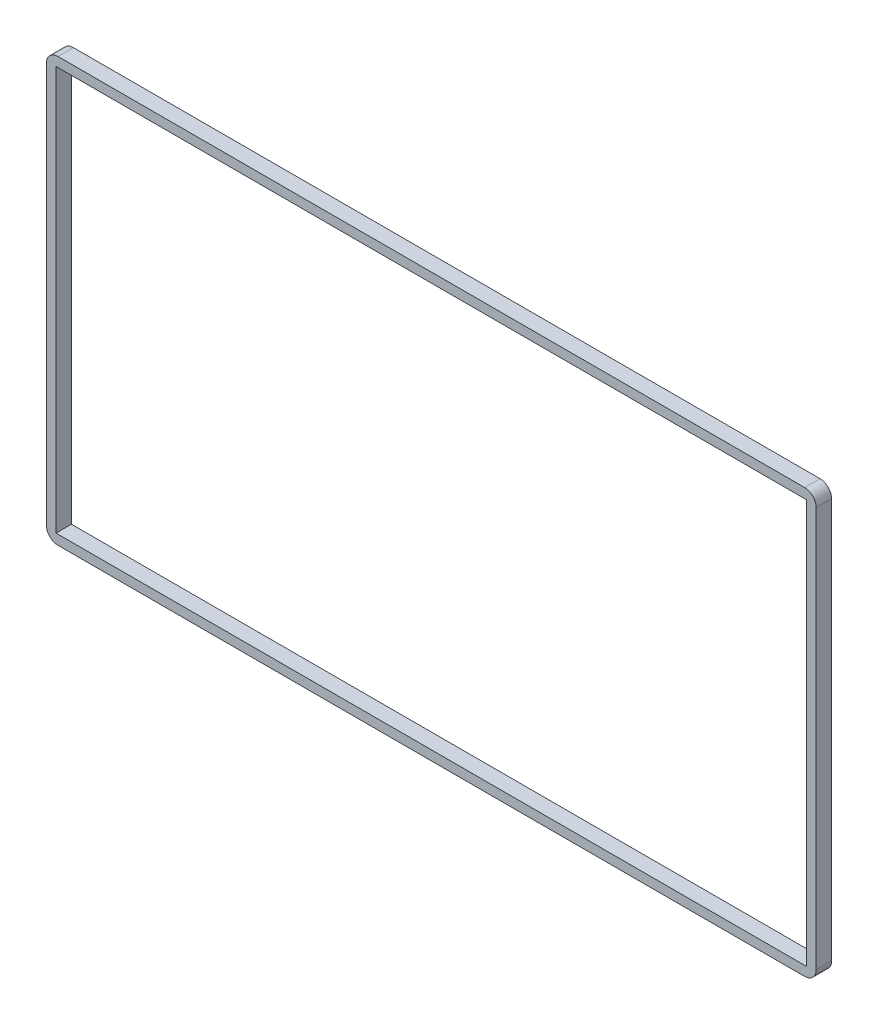
ISO-10303-21;
HEADER;
FILE_DESCRIPTION(('STEP AP214'),'2;1');
FILE_NAME('part.step','',(''),(''),'','','');
FILE_SCHEMA(('AUTOMOTIVE_DESIGN { 1 0 10303 214 1 1 1 1 }'));
ENDSEC;
DATA;
#1=APPLICATION_CONTEXT('core data for automotive mechanical design processes');
#2=APPLICATION_PROTOCOL_DEFINITION('international standard','automotive_design',2000,#1);
#3=PRODUCT_CONTEXT('',#1,'mechanical');
#4=PRODUCT('Part','Part','',(#3));
#5=PRODUCT_RELATED_PRODUCT_CATEGORY('part','',(#4));
#6=PRODUCT_DEFINITION_FORMATION('','',#4);
#7=PRODUCT_DEFINITION_CONTEXT('part definition',#1,'design');
#8=PRODUCT_DEFINITION('design','',#6,#7);
#9=PRODUCT_DEFINITION_SHAPE('','',#8);
#10=(LENGTH_UNIT() NAMED_UNIT(*) SI_UNIT(.MILLI.,.METRE.));
#11=(NAMED_UNIT(*) PLANE_ANGLE_UNIT() SI_UNIT($,.RADIAN.));
#12=(NAMED_UNIT(*) SI_UNIT($,.STERADIAN.) SOLID_ANGLE_UNIT());
#13=UNCERTAINTY_MEASURE_WITH_UNIT(LENGTH_MEASURE(1.E-05),#10,'distance_accuracy_value','');
#14=(GEOMETRIC_REPRESENTATION_CONTEXT(3) GLOBAL_UNCERTAINTY_ASSIGNED_CONTEXT((#13)) GLOBAL_UNIT_ASSIGNED_CONTEXT((#10,
#11,#12)) REPRESENTATION_CONTEXT('',''));
#15=CARTESIAN_POINT('',(0.,0.,0.));
#16=DIRECTION('',(0.,0.,1.));
#17=DIRECTION('',(1.,0.,0.));
#18=AXIS2_PLACEMENT_3D('',#15,#16,#17);
#19=CARTESIAN_POINT('',(0.,0.,2.));
#20=DIRECTION('',(0.,0.,-1.));
#21=DIRECTION('',(-1.,0.,0.));
#22=AXIS2_PLACEMENT_3D('',#19,#20,#21);
#23=PLANE('',#22);
#24=DIRECTION('',(0.,-1.,0.));
#25=VECTOR('',#24,1.);
#26=CARTESIAN_POINT('',(-37.8969711699355,-16.3484963131282,2.));
#27=LINE('',#26,#25);
#28=CARTESIAN_POINT('',(-37.8969711699355,37.1515036868718,2.));
#29=VERTEX_POINT('',#28);
#30=CARTESIAN_POINT('',(-37.8969711699355,-14.8484963131282,2.));
#31=VERTEX_POINT('',#30);
#32=EDGE_CURVE('E168',#29,#31,#27,.T.);
#33=ORIENTED_EDGE('',*,*,#32,.T.);
#34=CARTESIAN_POINT('',(-36.3969711699355,-14.8484963131282,2.));
#35=DIRECTION('',(0.,0.,-1.));
#36=DIRECTION('',(-1.,0.,0.));
#37=AXIS2_PLACEMENT_3D('',#34,#35,#36);
#38=CIRCLE('',#37,1.5);
#39=CARTESIAN_POINT('',(-36.3969711699355,-16.3484963131282,2.));
#40=VERTEX_POINT('',#39);
#41=EDGE_CURVE('E211',#31,#40,#38,.F.);
#42=ORIENTED_EDGE('',*,*,#41,.T.);
#43=DIRECTION('',(1.,0.,0.));
#44=VECTOR('',#43,1.);
#45=CARTESIAN_POINT('',(-37.8969711699355,-16.3484963131282,2.));
#46=LINE('',#45,#44);
#47=CARTESIAN_POINT('',(60.6030288300645,-16.3484963131282,2.));
#48=VERTEX_POINT('',#47);
#49=EDGE_CURVE('E171',#40,#48,#46,.T.);
#50=ORIENTED_EDGE('',*,*,#49,.T.);
#51=CARTESIAN_POINT('',(60.6030288300645,-14.8484963131282,2.));
#52=DIRECTION('',(0.,0.,-1.));
#53=DIRECTION('',(-1.,0.,0.));
#54=AXIS2_PLACEMENT_3D('',#51,#52,#53);
#55=CIRCLE('',#54,1.5);
#56=CARTESIAN_POINT('',(62.1030288300645,-14.8484963131282,2.));
#57=VERTEX_POINT('',#56);
#58=EDGE_CURVE('E209',#48,#57,#55,.F.);
#59=ORIENTED_EDGE('',*,*,#58,.T.);
#60=DIRECTION('',(0.,1.,0.));
#61=VECTOR('',#60,1.);
#62=CARTESIAN_POINT('',(62.1030288300645,-16.3484963131282,2.));
#63=LINE('',#62,#61);
#64=CARTESIAN_POINT('',(62.1030288300645,37.1515036868718,2.));
#65=VERTEX_POINT('',#64);
#66=EDGE_CURVE('E175',#57,#65,#63,.T.);
#67=ORIENTED_EDGE('',*,*,#66,.T.);
#68=CARTESIAN_POINT('',(60.6030288300645,37.1515036868718,2.));
#69=DIRECTION('',(0.,0.,-1.));
#70=DIRECTION('',(-1.,0.,0.));
#71=AXIS2_PLACEMENT_3D('',#68,#69,#70);
#72=CIRCLE('',#71,1.5);
#73=CARTESIAN_POINT('',(60.6030288300645,38.6515036868718,2.));
#74=VERTEX_POINT('',#73);
#75=EDGE_CURVE('E57',#65,#74,#72,.F.);
#76=ORIENTED_EDGE('',*,*,#75,.T.);
#77=DIRECTION('',(-1.,0.,0.));
#78=VECTOR('',#77,1.);
#79=CARTESIAN_POINT('',(-37.8969711699355,38.6515036868718,2.));
#80=LINE('',#79,#78);
#81=CARTESIAN_POINT('',(-36.3969711699355,38.6515036868718,2.));
#82=VERTEX_POINT('',#81);
#83=EDGE_CURVE('E177',#74,#82,#80,.T.);
#84=ORIENTED_EDGE('',*,*,#83,.T.);
#85=CARTESIAN_POINT('',(-36.3969711699355,37.1515036868718,2.));
#86=DIRECTION('',(0.,0.,-1.));
#87=DIRECTION('',(-1.,0.,0.));
#88=AXIS2_PLACEMENT_3D('',#85,#86,#87);
#89=CIRCLE('',#88,1.5);
#90=EDGE_CURVE('E206',#82,#29,#89,.F.);
#91=ORIENTED_EDGE('',*,*,#90,.T.);
#92=EDGE_LOOP('',(#33,#42,#50,#59,#67,#76,#84,#91));
#93=FACE_BOUND('',#92,.T.);
#94=DIRECTION('',(0.,-1.,0.));
#95=VECTOR('',#94,1.);
#96=CARTESIAN_POINT('',(-36.6469711699355,37.4015036868718,2.));
#97=LINE('',#96,#95);
#98=CARTESIAN_POINT('',(-36.6469711699355,37.4015036868718,2.));
#99=VERTEX_POINT('',#98);
#100=CARTESIAN_POINT('',(-36.6469711699355,-15.0984963131282,2.));
#101=VERTEX_POINT('',#100);
#102=EDGE_CURVE('E127',#99,#101,#97,.T.);
#103=ORIENTED_EDGE('',*,*,#102,.F.);
#104=DIRECTION('',(-1.,0.,0.));
#105=VECTOR('',#104,1.);
#106=CARTESIAN_POINT('',(-36.6469711699355,37.4015036868718,2.));
#107=LINE('',#106,#105);
#108=CARTESIAN_POINT('',(60.8530288300645,37.4015036868718,2.));
#109=VERTEX_POINT('',#108);
#110=EDGE_CURVE('E152',#109,#99,#107,.T.);
#111=ORIENTED_EDGE('',*,*,#110,.F.);
#112=DIRECTION('',(0.,1.,0.));
#113=VECTOR('',#112,1.);
#114=CARTESIAN_POINT('',(60.8530288300645,37.4015036868718,2.));
#115=LINE('',#114,#113);
#116=CARTESIAN_POINT('',(60.8530288300645,-15.0984963131282,2.));
#117=VERTEX_POINT('',#116);
#118=EDGE_CURVE('E150',#117,#109,#115,.T.);
#119=ORIENTED_EDGE('',*,*,#118,.F.);
#120=DIRECTION('',(1.,0.,0.));
#121=VECTOR('',#120,1.);
#122=CARTESIAN_POINT('',(-36.6469711699355,-15.0984963131282,2.));
#123=LINE('',#122,#121);
#124=EDGE_CURVE('E137',#101,#117,#123,.T.);
#125=ORIENTED_EDGE('',*,*,#124,.F.);
#126=EDGE_LOOP('',(#103,#111,#119,#125));
#127=FACE_BOUND('',#126,.T.);
#128=ADVANCED_FACE('F36',(#93,#127),#23,.F.);
#129=CARTESIAN_POINT('',(0.,0.,0.));
#130=DIRECTION('',(0.,0.,-1.));
#131=DIRECTION('',(-1.,0.,0.));
#132=AXIS2_PLACEMENT_3D('',#129,#130,#131);
#133=PLANE('',#132);
#134=DIRECTION('',(1.,0.,0.));
#135=VECTOR('',#134,1.);
#136=CARTESIAN_POINT('',(-37.8969711699355,-16.3484963131282,0.));
#137=LINE('',#136,#135);
#138=CARTESIAN_POINT('',(-36.3969711699355,-16.3484963131282,0.));
#139=VERTEX_POINT('',#138);
#140=CARTESIAN_POINT('',(60.6030288300645,-16.3484963131282,0.));
#141=VERTEX_POINT('',#140);
#142=EDGE_CURVE('E182',#139,#141,#137,.T.);
#143=ORIENTED_EDGE('',*,*,#142,.F.);
#144=CARTESIAN_POINT('',(-36.3969711699355,-14.8484963131282,0.));
#145=DIRECTION('',(0.,0.,-1.));
#146=DIRECTION('',(-1.,0.,0.));
#147=AXIS2_PLACEMENT_3D('',#144,#145,#146);
#148=CIRCLE('',#147,1.5);
#149=CARTESIAN_POINT('',(-37.8969711699355,-14.8484963131282,0.));
#150=VERTEX_POINT('',#149);
#151=EDGE_CURVE('E199',#139,#150,#148,.T.);
#152=ORIENTED_EDGE('',*,*,#151,.T.);
#153=DIRECTION('',(0.,-1.,0.));
#154=VECTOR('',#153,1.);
#155=CARTESIAN_POINT('',(-37.8969711699355,-16.3484963131282,0.));
#156=LINE('',#155,#154);
#157=CARTESIAN_POINT('',(-37.8969711699355,37.1515036868718,0.));
#158=VERTEX_POINT('',#157);
#159=EDGE_CURVE('E145',#158,#150,#156,.T.);
#160=ORIENTED_EDGE('',*,*,#159,.F.);
#161=CARTESIAN_POINT('',(-36.3969711699355,37.1515036868718,0.));
#162=DIRECTION('',(0.,0.,-1.));
#163=DIRECTION('',(-1.,0.,0.));
#164=AXIS2_PLACEMENT_3D('',#161,#162,#163);
#165=CIRCLE('',#164,1.5);
#166=CARTESIAN_POINT('',(-36.3969711699355,38.6515036868718,0.));
#167=VERTEX_POINT('',#166);
#168=EDGE_CURVE('E193',#158,#167,#165,.T.);
#169=ORIENTED_EDGE('',*,*,#168,.T.);
#170=DIRECTION('',(-1.,0.,0.));
#171=VECTOR('',#170,1.);
#172=CARTESIAN_POINT('',(-37.8969711699355,38.6515036868718,0.));
#173=LINE('',#172,#171);
#174=CARTESIAN_POINT('',(60.6030288300645,38.6515036868718,0.));
#175=VERTEX_POINT('',#174);
#176=EDGE_CURVE('E172',#175,#167,#173,.T.);
#177=ORIENTED_EDGE('',*,*,#176,.F.);
#178=CARTESIAN_POINT('',(60.6030288300645,37.1515036868718,0.));
#179=DIRECTION('',(0.,0.,-1.));
#180=DIRECTION('',(-1.,0.,0.));
#181=AXIS2_PLACEMENT_3D('',#178,#179,#180);
#182=CIRCLE('',#181,1.5);
#183=CARTESIAN_POINT('',(62.1030288300645,37.1515036868718,0.));
#184=VERTEX_POINT('',#183);
#185=EDGE_CURVE('E195',#175,#184,#182,.T.);
#186=ORIENTED_EDGE('',*,*,#185,.T.);
#187=DIRECTION('',(0.,1.,0.));
#188=VECTOR('',#187,1.);
#189=CARTESIAN_POINT('',(62.1030288300645,-16.3484963131282,0.));
#190=LINE('',#189,#188);
#191=CARTESIAN_POINT('',(62.1030288300645,-14.8484963131282,0.));
#192=VERTEX_POINT('',#191);
#193=EDGE_CURVE('E185',#192,#184,#190,.T.);
#194=ORIENTED_EDGE('',*,*,#193,.F.);
#195=CARTESIAN_POINT('',(60.6030288300645,-14.8484963131282,0.));
#196=DIRECTION('',(0.,0.,-1.));
#197=DIRECTION('',(-1.,0.,0.));
#198=AXIS2_PLACEMENT_3D('',#195,#196,#197);
#199=CIRCLE('',#198,1.5);
#200=EDGE_CURVE('E197',#192,#141,#199,.T.);
#201=ORIENTED_EDGE('',*,*,#200,.T.);
#202=EDGE_LOOP('',(#143,#152,#160,#169,#177,#186,#194,#201));
#203=FACE_BOUND('',#202,.T.);
#204=DIRECTION('',(-1.,0.,0.));
#205=VECTOR('',#204,1.);
#206=CARTESIAN_POINT('',(-36.6469711699355,37.4015036868718,0.));
#207=LINE('',#206,#205);
#208=CARTESIAN_POINT('',(60.8530288300645,37.4015036868718,0.));
#209=VERTEX_POINT('',#208);
#210=CARTESIAN_POINT('',(-36.6469711699355,37.4015036868718,0.));
#211=VERTEX_POINT('',#210);
#212=EDGE_CURVE('E138',#209,#211,#207,.T.);
#213=ORIENTED_EDGE('',*,*,#212,.T.);
#214=DIRECTION('',(0.,-1.,0.));
#215=VECTOR('',#214,1.);
#216=CARTESIAN_POINT('',(-36.6469711699355,37.4015036868718,0.));
#217=LINE('',#216,#215);
#218=CARTESIAN_POINT('',(-36.6469711699355,-15.0984963131282,0.));
#219=VERTEX_POINT('',#218);
#220=EDGE_CURVE('E156',#211,#219,#217,.T.);
#221=ORIENTED_EDGE('',*,*,#220,.T.);
#222=DIRECTION('',(1.,0.,0.));
#223=VECTOR('',#222,1.);
#224=CARTESIAN_POINT('',(-36.6469711699355,-15.0984963131282,0.));
#225=LINE('',#224,#223);
#226=CARTESIAN_POINT('',(60.8530288300645,-15.0984963131282,0.));
#227=VERTEX_POINT('',#226);
#228=EDGE_CURVE('E144',#219,#227,#225,.T.);
#229=ORIENTED_EDGE('',*,*,#228,.T.);
#230=DIRECTION('',(0.,1.,0.));
#231=VECTOR('',#230,1.);
#232=CARTESIAN_POINT('',(60.8530288300645,37.4015036868718,0.));
#233=LINE('',#232,#231);
#234=EDGE_CURVE('E159',#227,#209,#233,.T.);
#235=ORIENTED_EDGE('',*,*,#234,.T.);
#236=EDGE_LOOP('',(#213,#221,#229,#235));
#237=FACE_BOUND('',#236,.T.);
#238=ADVANCED_FACE('F227',(#203,#237),#133,.T.);
#239=CARTESIAN_POINT('',(-37.8969711699355,-16.3484963131282,2.));
#240=DIRECTION('',(1.,0.,0.));
#241=DIRECTION('',(0.,0.,-1.));
#242=AXIS2_PLACEMENT_3D('',#239,#240,#241);
#243=PLANE('',#242);
#244=ORIENTED_EDGE('',*,*,#159,.T.);
#245=DIRECTION('',(0.,0.,-1.));
#246=VECTOR('',#245,1.);
#247=CARTESIAN_POINT('',(-37.8969711699355,-14.8484963131282,2.));
#248=LINE('',#247,#246);
#249=EDGE_CURVE('E204',#150,#31,#248,.F.);
#250=ORIENTED_EDGE('',*,*,#249,.T.);
#251=ORIENTED_EDGE('',*,*,#32,.F.);
#252=DIRECTION('',(0.,0.,-1.));
#253=VECTOR('',#252,1.);
#254=CARTESIAN_POINT('',(-37.8969711699355,37.1515036868718,2.));
#255=LINE('',#254,#253);
#256=EDGE_CURVE('E201',#29,#158,#255,.T.);
#257=ORIENTED_EDGE('',*,*,#256,.T.);
#258=EDGE_LOOP('',(#244,#250,#251,#257));
#259=FACE_BOUND('',#258,.T.);
#260=ADVANCED_FACE('F240',(#259),#243,.F.);
#261=CARTESIAN_POINT('',(-37.8969711699355,-16.3484963131282,2.));
#262=DIRECTION('',(0.,1.,0.));
#263=DIRECTION('',(0.,0.,1.));
#264=AXIS2_PLACEMENT_3D('',#261,#262,#263);
#265=PLANE('',#264);
#266=ORIENTED_EDGE('',*,*,#49,.F.);
#267=DIRECTION('',(0.,0.,-1.));
#268=VECTOR('',#267,1.);
#269=CARTESIAN_POINT('',(-36.3969711699355,-16.3484963131282,2.));
#270=LINE('',#269,#268);
#271=EDGE_CURVE('E190',#40,#139,#270,.T.);
#272=ORIENTED_EDGE('',*,*,#271,.T.);
#273=ORIENTED_EDGE('',*,*,#142,.T.);
#274=DIRECTION('',(0.,0.,-1.));
#275=VECTOR('',#274,1.);
#276=CARTESIAN_POINT('',(60.6030288300645,-16.3484963131282,2.));
#277=LINE('',#276,#275);
#278=EDGE_CURVE('E179',#141,#48,#277,.F.);
#279=ORIENTED_EDGE('',*,*,#278,.T.);
#280=EDGE_LOOP('',(#266,#272,#273,#279));
#281=FACE_BOUND('',#280,.T.);
#282=ADVANCED_FACE('F248',(#281),#265,.F.);
#283=CARTESIAN_POINT('',(62.1030288300645,-16.3484963131282,2.));
#284=DIRECTION('',(-1.,0.,0.));
#285=DIRECTION('',(0.,0.,1.));
#286=AXIS2_PLACEMENT_3D('',#283,#284,#285);
#287=PLANE('',#286);
#288=ORIENTED_EDGE('',*,*,#66,.F.);
#289=DIRECTION('',(0.,0.,-1.));
#290=VECTOR('',#289,1.);
#291=CARTESIAN_POINT('',(62.1030288300645,-14.8484963131282,2.));
#292=LINE('',#291,#290);
#293=EDGE_CURVE('E215',#57,#192,#292,.T.);
#294=ORIENTED_EDGE('',*,*,#293,.T.);
#295=ORIENTED_EDGE('',*,*,#193,.T.);
#296=DIRECTION('',(0.,0.,-1.));
#297=VECTOR('',#296,1.);
#298=CARTESIAN_POINT('',(62.1030288300645,37.1515036868718,2.));
#299=LINE('',#298,#297);
#300=EDGE_CURVE('E213',#184,#65,#299,.F.);
#301=ORIENTED_EDGE('',*,*,#300,.T.);
#302=EDGE_LOOP('',(#288,#294,#295,#301));
#303=FACE_BOUND('',#302,.T.);
#304=ADVANCED_FACE('F221',(#303),#287,.F.);
#305=CARTESIAN_POINT('',(-37.8969711699355,38.6515036868718,2.));
#306=DIRECTION('',(0.,-1.,0.));
#307=DIRECTION('',(0.,0.,-1.));
#308=AXIS2_PLACEMENT_3D('',#305,#306,#307);
#309=PLANE('',#308);
#310=ORIENTED_EDGE('',*,*,#83,.F.);
#311=DIRECTION('',(0.,0.,-1.));
#312=VECTOR('',#311,1.);
#313=CARTESIAN_POINT('',(60.6030288300645,38.6515036868718,2.));
#314=LINE('',#313,#312);
#315=EDGE_CURVE('E12',#74,#175,#314,.T.);
#316=ORIENTED_EDGE('',*,*,#315,.T.);
#317=ORIENTED_EDGE('',*,*,#176,.T.);
#318=DIRECTION('',(0.,0.,-1.));
#319=VECTOR('',#318,1.);
#320=CARTESIAN_POINT('',(-36.3969711699355,38.6515036868718,2.));
#321=LINE('',#320,#319);
#322=EDGE_CURVE('E44',#167,#82,#321,.F.);
#323=ORIENTED_EDGE('',*,*,#322,.T.);
#324=EDGE_LOOP('',(#310,#316,#317,#323));
#325=FACE_BOUND('',#324,.T.);
#326=ADVANCED_FACE('F233',(#325),#309,.F.);
#327=CARTESIAN_POINT('',(-36.6469711699355,37.4015036868718,2.));
#328=DIRECTION('',(1.,0.,0.));
#329=DIRECTION('',(0.,1.,0.));
#330=AXIS2_PLACEMENT_3D('',#327,#328,#329);
#331=PLANE('',#330);
#332=ORIENTED_EDGE('',*,*,#220,.F.);
#333=DIRECTION('',(0.,0.,-1.));
#334=VECTOR('',#333,1.);
#335=CARTESIAN_POINT('',(-36.6469711699355,37.4015036868718,2.));
#336=LINE('',#335,#334);
#337=EDGE_CURVE('E133',#99,#211,#336,.T.);
#338=ORIENTED_EDGE('',*,*,#337,.F.);
#339=ORIENTED_EDGE('',*,*,#102,.T.);
#340=DIRECTION('',(0.,0.,-1.));
#341=VECTOR('',#340,1.);
#342=CARTESIAN_POINT('',(-36.6469711699355,-15.0984963131282,2.));
#343=LINE('',#342,#341);
#344=EDGE_CURVE('E130',#101,#219,#343,.T.);
#345=ORIENTED_EDGE('',*,*,#344,.T.);
#346=EDGE_LOOP('',(#332,#338,#339,#345));
#347=FACE_BOUND('',#346,.T.);
#348=ADVANCED_FACE('F129',(#347),#331,.T.);
#349=CARTESIAN_POINT('',(-36.6469711699355,-15.0984963131282,2.));
#350=DIRECTION('',(0.,1.,0.));
#351=DIRECTION('',(-1.,0.,0.));
#352=AXIS2_PLACEMENT_3D('',#349,#350,#351);
#353=PLANE('',#352);
#354=ORIENTED_EDGE('',*,*,#228,.F.);
#355=ORIENTED_EDGE('',*,*,#344,.F.);
#356=ORIENTED_EDGE('',*,*,#124,.T.);
#357=DIRECTION('',(0.,0.,-1.));
#358=VECTOR('',#357,1.);
#359=CARTESIAN_POINT('',(60.8530288300645,-15.0984963131282,2.));
#360=LINE('',#359,#358);
#361=EDGE_CURVE('E146',#117,#227,#360,.T.);
#362=ORIENTED_EDGE('',*,*,#361,.T.);
#363=EDGE_LOOP('',(#354,#355,#356,#362));
#364=FACE_BOUND('',#363,.T.);
#365=ADVANCED_FACE('F141',(#364),#353,.T.);
#366=CARTESIAN_POINT('',(60.8530288300645,37.4015036868718,2.));
#367=DIRECTION('',(-1.,0.,0.));
#368=DIRECTION('',(0.,-1.,0.));
#369=AXIS2_PLACEMENT_3D('',#366,#367,#368);
#370=PLANE('',#369);
#371=ORIENTED_EDGE('',*,*,#234,.F.);
#372=ORIENTED_EDGE('',*,*,#361,.F.);
#373=ORIENTED_EDGE('',*,*,#118,.T.);
#374=DIRECTION('',(0.,0.,-1.));
#375=VECTOR('',#374,1.);
#376=CARTESIAN_POINT('',(60.8530288300645,37.4015036868718,2.));
#377=LINE('',#376,#375);
#378=EDGE_CURVE('E165',#109,#209,#377,.T.);
#379=ORIENTED_EDGE('',*,*,#378,.T.);
#380=EDGE_LOOP('',(#371,#372,#373,#379));
#381=FACE_BOUND('',#380,.T.);
#382=ADVANCED_FACE('F303',(#381),#370,.T.);
#383=CARTESIAN_POINT('',(-36.6469711699355,37.4015036868718,2.));
#384=DIRECTION('',(0.,-1.,0.));
#385=DIRECTION('',(0.,0.,-1.));
#386=AXIS2_PLACEMENT_3D('',#383,#384,#385);
#387=PLANE('',#386);
#388=ORIENTED_EDGE('',*,*,#212,.F.);
#389=ORIENTED_EDGE('',*,*,#378,.F.);
#390=ORIENTED_EDGE('',*,*,#110,.T.);
#391=ORIENTED_EDGE('',*,*,#337,.T.);
#392=EDGE_LOOP('',(#388,#389,#390,#391));
#393=FACE_BOUND('',#392,.T.);
#394=ADVANCED_FACE('F257',(#393),#387,.T.);
#395=CARTESIAN_POINT('',(-36.3969711699355,-14.8484963131282,2.));
#396=DIRECTION('',(0.,0.,-1.));
#397=DIRECTION('',(-1.,0.,0.));
#398=AXIS2_PLACEMENT_3D('',#395,#396,#397);
#399=CYLINDRICAL_SURFACE('',#398,1.5);
#400=ORIENTED_EDGE('',*,*,#41,.F.);
#401=ORIENTED_EDGE('',*,*,#249,.F.);
#402=ORIENTED_EDGE('',*,*,#151,.F.);
#403=ORIENTED_EDGE('',*,*,#271,.F.);
#404=EDGE_LOOP('',(#400,#401,#402,#403));
#405=FACE_BOUND('',#404,.T.);
#406=ADVANCED_FACE('F245',(#405),#399,.T.);
#407=CARTESIAN_POINT('',(60.6030288300645,-14.8484963131282,2.));
#408=DIRECTION('',(0.,0.,-1.));
#409=DIRECTION('',(-1.,0.,0.));
#410=AXIS2_PLACEMENT_3D('',#407,#408,#409);
#411=CYLINDRICAL_SURFACE('',#410,1.5);
#412=ORIENTED_EDGE('',*,*,#58,.F.);
#413=ORIENTED_EDGE('',*,*,#278,.F.);
#414=ORIENTED_EDGE('',*,*,#200,.F.);
#415=ORIENTED_EDGE('',*,*,#293,.F.);
#416=EDGE_LOOP('',(#412,#413,#414,#415));
#417=FACE_BOUND('',#416,.T.);
#418=ADVANCED_FACE('F250',(#417),#411,.T.);
#419=CARTESIAN_POINT('',(60.6030288300645,37.1515036868718,2.));
#420=DIRECTION('',(0.,0.,-1.));
#421=DIRECTION('',(-1.,0.,0.));
#422=AXIS2_PLACEMENT_3D('',#419,#420,#421);
#423=CYLINDRICAL_SURFACE('',#422,1.5);
#424=ORIENTED_EDGE('',*,*,#75,.F.);
#425=ORIENTED_EDGE('',*,*,#300,.F.);
#426=ORIENTED_EDGE('',*,*,#185,.F.);
#427=ORIENTED_EDGE('',*,*,#315,.F.);
#428=EDGE_LOOP('',(#424,#425,#426,#427));
#429=FACE_BOUND('',#428,.T.);
#430=ADVANCED_FACE('F232',(#429),#423,.T.);
#431=CARTESIAN_POINT('',(-36.3969711699355,37.1515036868718,2.));
#432=DIRECTION('',(0.,0.,-1.));
#433=DIRECTION('',(-1.,0.,0.));
#434=AXIS2_PLACEMENT_3D('',#431,#432,#433);
#435=CYLINDRICAL_SURFACE('',#434,1.5);
#436=ORIENTED_EDGE('',*,*,#90,.F.);
#437=ORIENTED_EDGE('',*,*,#322,.F.);
#438=ORIENTED_EDGE('',*,*,#168,.F.);
#439=ORIENTED_EDGE('',*,*,#256,.F.);
#440=EDGE_LOOP('',(#436,#437,#438,#439));
#441=FACE_BOUND('',#440,.T.);
#442=ADVANCED_FACE('F38',(#441),#435,.T.);
#443=CLOSED_SHELL('',(#128,#238,#260,#282,#304,#326,#348,#365,#382,#394,#406,#418,#430,#442));
#444=MANIFOLD_SOLID_BREP('B2',#443);
#445=ADVANCED_BREP_SHAPE_REPRESENTATION('',(#18,#444),#14);
#446=SHAPE_DEFINITION_REPRESENTATION(#9,#445);
ENDSEC;
END-ISO-10303-21;
